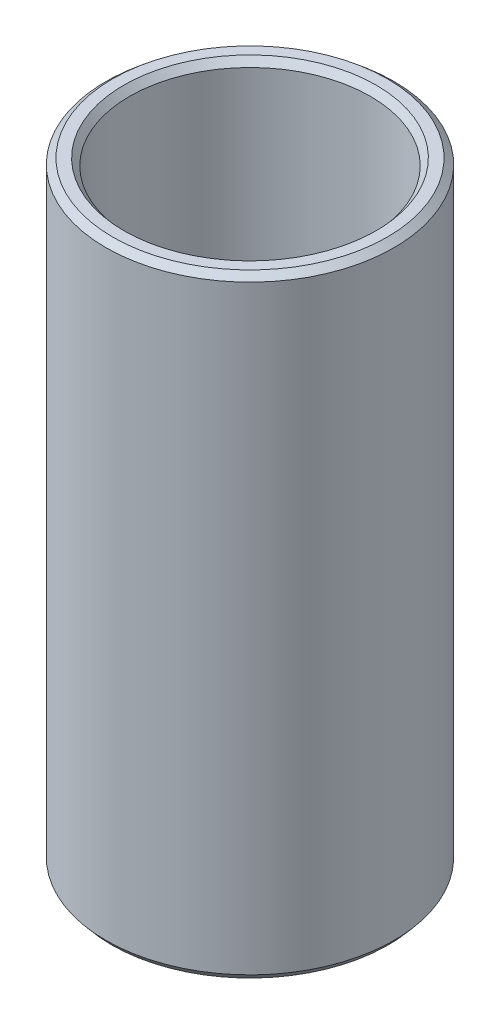
ISO-10303-21;
HEADER;
FILE_DESCRIPTION(('STEP AP214'),'2;1');
FILE_NAME('part.step','',(''),(''),'','','');
FILE_SCHEMA(('AUTOMOTIVE_DESIGN { 1 0 10303 214 1 1 1 1 }'));
ENDSEC;
DATA;
#1=APPLICATION_CONTEXT('core data for automotive mechanical design processes');
#2=APPLICATION_PROTOCOL_DEFINITION('international standard','automotive_design',2000,#1);
#3=PRODUCT_CONTEXT('',#1,'mechanical');
#4=PRODUCT('Part','Part','',(#3));
#5=PRODUCT_RELATED_PRODUCT_CATEGORY('part','',(#4));
#6=PRODUCT_DEFINITION_FORMATION('','',#4);
#7=PRODUCT_DEFINITION_CONTEXT('part definition',#1,'design');
#8=PRODUCT_DEFINITION('design','',#6,#7);
#9=PRODUCT_DEFINITION_SHAPE('','',#8);
#10=(LENGTH_UNIT() NAMED_UNIT(*) SI_UNIT(.MILLI.,.METRE.));
#11=(NAMED_UNIT(*) PLANE_ANGLE_UNIT() SI_UNIT($,.RADIAN.));
#12=(NAMED_UNIT(*) SI_UNIT($,.STERADIAN.) SOLID_ANGLE_UNIT());
#13=UNCERTAINTY_MEASURE_WITH_UNIT(LENGTH_MEASURE(1.E-05),#10,'distance_accuracy_value','');
#14=(GEOMETRIC_REPRESENTATION_CONTEXT(3) GLOBAL_UNCERTAINTY_ASSIGNED_CONTEXT((#13)) GLOBAL_UNIT_ASSIGNED_CONTEXT((#10,
#11,#12)) REPRESENTATION_CONTEXT('',''));
#15=CARTESIAN_POINT('',(0.,0.,0.));
#16=DIRECTION('',(0.,0.,1.));
#17=DIRECTION('',(1.,0.,0.));
#18=AXIS2_PLACEMENT_3D('',#15,#16,#17);
#19=CARTESIAN_POINT('',(0.,201.987912518107,0.));
#20=DIRECTION('',(0.,-1.,0.));
#21=DIRECTION('',(0.,0.,-1.));
#22=AXIS2_PLACEMENT_3D('',#19,#20,#21);
#23=CYLINDRICAL_SURFACE('',#22,47.5);
#24=CARTESIAN_POINT('',(0.,2.24651685545349,0.));
#25=DIRECTION('',(0.,1.,0.));
#26=DIRECTION('',(0.,0.,1.));
#27=AXIS2_PLACEMENT_3D('',#24,#25,#26);
#28=CIRCLE('',#27,47.5);
#29=CARTESIAN_POINT('',(0.,2.24651685545349,47.5));
#30=VERTEX_POINT('',#29);
#31=EDGE_CURVE('E10',#30,#30,#28,.T.);
#32=ORIENTED_EDGE('',*,*,#31,.T.);
#33=EDGE_LOOP('',(#32));
#34=FACE_BOUND('',#33,.T.);
#35=CARTESIAN_POINT('',(0.,200.089997163598,0.));
#36=DIRECTION('',(0.,1.,0.));
#37=DIRECTION('',(0.,0.,1.));
#38=AXIS2_PLACEMENT_3D('',#35,#36,#37);
#39=CIRCLE('',#38,47.5);
#40=CARTESIAN_POINT('',(0.,200.089997163598,-47.5));
#41=VERTEX_POINT('',#40);
#42=EDGE_CURVE('E50',#41,#41,#39,.F.);
#43=ORIENTED_EDGE('',*,*,#42,.T.);
#44=EDGE_LOOP('',(#43));
#45=FACE_BOUND('',#44,.T.);
#46=ADVANCED_FACE('F39',(#34,#45),#23,.T.);
#47=CARTESIAN_POINT('',(0.,201.987912518107,0.));
#48=DIRECTION('',(0.,1.,0.));
#49=DIRECTION('',(0.,0.,1.));
#50=AXIS2_PLACEMENT_3D('',#47,#48,#49);
#51=PLANE('',#50);
#52=CARTESIAN_POINT('',(0.,201.987912518107,0.));
#53=DIRECTION('',(0.,1.,0.));
#54=DIRECTION('',(0.,0.,1.));
#55=AXIS2_PLACEMENT_3D('',#52,#53,#54);
#56=CIRCLE('',#55,41.604513918867);
#57=CARTESIAN_POINT('',(0.,201.987912518107,41.604513918867));
#58=VERTEX_POINT('',#57);
#59=EDGE_CURVE('E58',#58,#58,#56,.F.);
#60=ORIENTED_EDGE('',*,*,#59,.T.);
#61=EDGE_LOOP('',(#60));
#62=FACE_BOUND('',#61,.T.);
#63=CARTESIAN_POINT('',(0.,201.987912518107,0.));
#64=DIRECTION('',(0.,1.,0.));
#65=DIRECTION('',(0.,0.,1.));
#66=AXIS2_PLACEMENT_3D('',#63,#64,#65);
#67=CIRCLE('',#66,45.2534831445465);
#68=CARTESIAN_POINT('',(0.,201.987912518107,-45.2534831445465));
#69=VERTEX_POINT('',#68);
#70=EDGE_CURVE('E61',#69,#69,#67,.T.);
#71=ORIENTED_EDGE('',*,*,#70,.T.);
#72=EDGE_LOOP('',(#71));
#73=FACE_BOUND('',#72,.T.);
#74=ADVANCED_FACE('F88',(#62,#73),#51,.T.);
#75=CARTESIAN_POINT('',(0.,0.,0.));
#76=DIRECTION('',(0.,1.,0.));
#77=DIRECTION('',(0.,0.,1.));
#78=AXIS2_PLACEMENT_3D('',#75,#76,#77);
#79=PLANE('',#78);
#80=CARTESIAN_POINT('',(0.,0.,0.));
#81=DIRECTION('',(0.,1.,0.));
#82=DIRECTION('',(0.,0.,1.));
#83=AXIS2_PLACEMENT_3D('',#80,#81,#82);
#84=CIRCLE('',#83,41.9531154198121);
#85=CARTESIAN_POINT('',(0.,0.,41.9531154198121));
#86=VERTEX_POINT('',#85);
#87=EDGE_CURVE('E51',#86,#86,#84,.T.);
#88=ORIENTED_EDGE('',*,*,#87,.T.);
#89=EDGE_LOOP('',(#88));
#90=FACE_BOUND('',#89,.T.);
#91=CARTESIAN_POINT('',(0.,0.,0.));
#92=DIRECTION('',(0.,1.,0.));
#93=DIRECTION('',(0.,0.,1.));
#94=AXIS2_PLACEMENT_3D('',#91,#92,#93);
#95=CIRCLE('',#94,45.6020846454915);
#96=CARTESIAN_POINT('',(0.,0.,45.6020846454915));
#97=VERTEX_POINT('',#96);
#98=EDGE_CURVE('E54',#97,#97,#95,.F.);
#99=ORIENTED_EDGE('',*,*,#98,.T.);
#100=EDGE_LOOP('',(#99));
#101=FACE_BOUND('',#100,.T.);
#102=ADVANCED_FACE('F83',(#90,#101),#79,.F.);
#103=CARTESIAN_POINT('',(0.,201.987912518107,0.));
#104=DIRECTION('',(0.,-1.,0.));
#105=DIRECTION('',(0.,0.,-1.));
#106=AXIS2_PLACEMENT_3D('',#103,#104,#105);
#107=CYLINDRICAL_SURFACE('',#106,39.7065985643585);
#108=CARTESIAN_POINT('',(0.,199.741395662653,0.));
#109=DIRECTION('',(0.,1.,0.));
#110=DIRECTION('',(0.,0.,1.));
#111=AXIS2_PLACEMENT_3D('',#108,#109,#110);
#112=CIRCLE('',#111,39.7065985643585);
#113=CARTESIAN_POINT('',(0.,199.741395662653,39.7065985643585));
#114=VERTEX_POINT('',#113);
#115=EDGE_CURVE('E67',#114,#114,#112,.T.);
#116=ORIENTED_EDGE('',*,*,#115,.T.);
#117=EDGE_LOOP('',(#116));
#118=FACE_BOUND('',#117,.T.);
#119=CARTESIAN_POINT('',(0.,1.89791535450856,0.));
#120=DIRECTION('',(0.,1.,0.));
#121=DIRECTION('',(0.,0.,1.));
#122=AXIS2_PLACEMENT_3D('',#119,#120,#121);
#123=CIRCLE('',#122,39.7065985643585);
#124=CARTESIAN_POINT('',(0.,1.89791535450856,39.7065985643585));
#125=VERTEX_POINT('',#124);
#126=EDGE_CURVE('E69',#125,#125,#123,.F.);
#127=ORIENTED_EDGE('',*,*,#126,.T.);
#128=EDGE_LOOP('',(#127));
#129=FACE_BOUND('',#128,.T.);
#130=ADVANCED_FACE('F71',(#118,#129),#107,.F.);
#131=CARTESIAN_POINT('',(0.,199.741395662653,0.));
#132=DIRECTION('',(0.,1.,0.));
#133=DIRECTION('',(0.,0.,1.));
#134=AXIS2_PLACEMENT_3D('',#131,#132,#133);
#135=CONICAL_SURFACE('',#134,39.7065985643585,0.701482482449643);
#136=ORIENTED_EDGE('',*,*,#59,.F.);
#137=EDGE_LOOP('',(#136));
#138=FACE_BOUND('',#137,.T.);
#139=ORIENTED_EDGE('',*,*,#115,.F.);
#140=EDGE_LOOP('',(#139));
#141=FACE_BOUND('',#140,.T.);
#142=ADVANCED_FACE('F77',(#138,#141),#135,.F.);
#143=CARTESIAN_POINT('',(0.,0.,0.));
#144=DIRECTION('',(0.,-1.,0.));
#145=DIRECTION('',(0.,0.,-1.));
#146=AXIS2_PLACEMENT_3D('',#143,#144,#145);
#147=CONICAL_SURFACE('',#146,41.9531154198121,0.869313844345249);
#148=ORIENTED_EDGE('',*,*,#126,.F.);
#149=EDGE_LOOP('',(#148));
#150=FACE_BOUND('',#149,.T.);
#151=ORIENTED_EDGE('',*,*,#87,.F.);
#152=EDGE_LOOP('',(#151));
#153=FACE_BOUND('',#152,.T.);
#154=ADVANCED_FACE('F73',(#150,#153),#147,.F.);
#155=CARTESIAN_POINT('',(0.,2.24651685545349,0.));
#156=DIRECTION('',(0.,1.,0.));
#157=DIRECTION('',(0.,0.,1.));
#158=AXIS2_PLACEMENT_3D('',#155,#156,#157);
#159=CONICAL_SURFACE('',#158,47.5,0.701482482449651);
#160=ORIENTED_EDGE('',*,*,#98,.F.);
#161=EDGE_LOOP('',(#160));
#162=FACE_BOUND('',#161,.T.);
#163=ORIENTED_EDGE('',*,*,#31,.F.);
#164=EDGE_LOOP('',(#163));
#165=FACE_BOUND('',#164,.T.);
#166=ADVANCED_FACE('F76',(#162,#165),#159,.T.);
#167=CARTESIAN_POINT('',(0.,201.987912518107,0.));
#168=DIRECTION('',(0.,-1.,0.));
#169=DIRECTION('',(0.,0.,-1.));
#170=AXIS2_PLACEMENT_3D('',#167,#168,#169);
#171=CONICAL_SURFACE('',#170,45.2534831445465,0.869313844345255);
#172=CARTESIAN_POINT('',(0.,200.089997163598,-47.5));
#173=CARTESIAN_POINT('',(0.,200.109767115208,-47.4765987827557));
#174=CARTESIAN_POINT('',(0.,200.129537066817,-47.4531975655114));
#175=CARTESIAN_POINT('',(0.,200.169076970036,-47.4063951310228));
#176=CARTESIAN_POINT('',(0.,200.188846921646,-47.3829939137785));
#177=CARTESIAN_POINT('',(0.,200.228386824864,-47.3361914792899));
#178=CARTESIAN_POINT('',(0.,200.248156776474,-47.3127902620456));
#179=CARTESIAN_POINT('',(0.,200.287696679693,-47.2659878275569));
#180=CARTESIAN_POINT('',(0.,200.307466631302,-47.2425866103126));
#181=CARTESIAN_POINT('',(0.,200.347006534521,-47.195784175824));
#182=CARTESIAN_POINT('',(0.,200.366776486131,-47.1723829585797));
#183=CARTESIAN_POINT('',(0.,200.40631638935,-47.1255805240911));
#184=CARTESIAN_POINT('',(0.,200.426086340959,-47.1021793068468));
#185=CARTESIAN_POINT('',(0.,200.465626244178,-47.0553768723582));
#186=CARTESIAN_POINT('',(0.,200.485396195787,-47.0319756551139));
#187=CARTESIAN_POINT('',(0.,200.524936099006,-46.9851732206253));
#188=CARTESIAN_POINT('',(0.,200.544706050616,-46.961772003381));
#189=CARTESIAN_POINT('',(0.,200.584245953835,-46.9149695688923));
#190=CARTESIAN_POINT('',(0.,200.604015905444,-46.891568351648));
#191=CARTESIAN_POINT('',(0.,200.643555808663,-46.8447659171594));
#192=CARTESIAN_POINT('',(0.,200.663325760273,-46.8213646999151));
#193=CARTESIAN_POINT('',(0.,200.702865663492,-46.7745622654265));
#194=CARTESIAN_POINT('',(0.,200.722635615101,-46.7511610481822));
#195=CARTESIAN_POINT('',(0.,200.76217551832,-46.7043586136936));
#196=CARTESIAN_POINT('',(0.,200.781945469929,-46.6809573964493));
#197=CARTESIAN_POINT('',(0.,200.821485373148,-46.6341549619606));
#198=CARTESIAN_POINT('',(0.,200.841255324758,-46.6107537447163));
#199=CARTESIAN_POINT('',(0.,200.880795227977,-46.5639513102277));
#200=CARTESIAN_POINT('',(0.,200.900565179586,-46.5405500929834));
#201=CARTESIAN_POINT('',(0.,200.940105082805,-46.4937476584948));
#202=CARTESIAN_POINT('',(0.,200.959875034415,-46.4703464412505));
#203=CARTESIAN_POINT('',(0.,200.999414937634,-46.4235440067619));
#204=CARTESIAN_POINT('',(0.,201.019184889243,-46.4001427895176));
#205=CARTESIAN_POINT('',(0.,201.058724792462,-46.353340355029));
#206=CARTESIAN_POINT('',(0.,201.078494744071,-46.3299391377847));
#207=CARTESIAN_POINT('',(0.,201.11803464729,-46.283136703296));
#208=CARTESIAN_POINT('',(0.,201.1378045989,-46.2597354860517));
#209=CARTESIAN_POINT('',(0.,201.177344502119,-46.2129330515631));
#210=CARTESIAN_POINT('',(0.,201.197114453728,-46.1895318343188));
#211=CARTESIAN_POINT('',(0.,201.236654356947,-46.1427293998302));
#212=CARTESIAN_POINT('',(0.,201.256424308557,-46.1193281825859));
#213=CARTESIAN_POINT('',(0.,201.295964211775,-46.0725257480973));
#214=CARTESIAN_POINT('',(0.,201.315734163385,-46.049124530853));
#215=CARTESIAN_POINT('',(0.,201.355274066604,-46.0023220963643));
#216=CARTESIAN_POINT('',(0.,201.375044018213,-45.97892087912));
#217=CARTESIAN_POINT('',(0.,201.414583921432,-45.9321184446314));
#218=CARTESIAN_POINT('',(0.,201.434353873042,-45.9087172273871));
#219=CARTESIAN_POINT('',(0.,201.473893776261,-45.8619147928985));
#220=CARTESIAN_POINT('',(0.,201.49366372787,-45.8385135756542));
#221=CARTESIAN_POINT('',(0.,201.533203631089,-45.7917111411656));
#222=CARTESIAN_POINT('',(0.,201.552973582698,-45.7683099239213));
#223=CARTESIAN_POINT('',(0.,201.592513485917,-45.7215074894327));
#224=CARTESIAN_POINT('',(0.,201.612283437527,-45.6981062721884));
#225=CARTESIAN_POINT('',(0.,201.651823340746,-45.6513038376997));
#226=CARTESIAN_POINT('',(0.,201.671593292355,-45.6279026204554));
#227=CARTESIAN_POINT('',(0.,201.711133195574,-45.5811001859668));
#228=CARTESIAN_POINT('',(0.,201.730903147184,-45.5576989687225));
#229=CARTESIAN_POINT('',(0.,201.770443050403,-45.5108965342339));
#230=CARTESIAN_POINT('',(0.,201.790213002012,-45.4874953169896));
#231=CARTESIAN_POINT('',(0.,201.829752905231,-45.440692882501));
#232=CARTESIAN_POINT('',(0.,201.84952285684,-45.4172916652567));
#233=CARTESIAN_POINT('',(0.,201.889062760059,-45.370489230768));
#234=CARTESIAN_POINT('',(0.,201.908832711669,-45.3470880135237));
#235=CARTESIAN_POINT('',(0.,201.948372614888,-45.3002855790351));
#236=CARTESIAN_POINT('',(0.,201.968142566497,-45.2768843617908));
#237=CARTESIAN_POINT('',(0.,201.987912518107,-45.2534831445465));
#238=B_SPLINE_CURVE_WITH_KNOTS('',3,(#172,#173,#174,#175,#176,#177,#178,#179,#180,#181,#182,
#183,#184,#185,#186,#187,#188,#189,#190,#191,#192,#193,#194,#195,#196,#197,#198,#199,#200,#201,
#202,#203,#204,#205,#206,#207,#208,#209,#210,#211,#212,#213,#214,#215,#216,#217,#218,#219,#220,
#221,#222,#223,#224,#225,#226,#227,#228,#229,#230,#231,#232,#233,#234,#235,#236,#237),
.UNSPECIFIED.,.F.,.F.,(4,2,2,2,2,2,2,2,2,2,2,2,2,2,2,2,2,2,2,2,2,2,2,2,2,2,2,2,2,2,2,2,4),(0.,
0.0919032730451126,0.183806546090202,0.275709819135297,0.367613092180409,0.459516365225504,
0.551419638270598,0.643322911315711,0.735226184360806,0.8271294574059,0.919032730451013,
1.01093600349611,1.1028392765412,1.19474254958631,1.28664582263141,1.3785490956765,
1.4704523687216,1.56235564176671,1.65425891481181,1.7461621878569,1.83806546090201,
1.92996873394711,2.0218720069922,2.11377528003732,2.20567855308241,2.2975818261275,
2.38948509917262,2.48138837221771,2.57329164526281,2.66519491830792,2.75709819135301,
2.84900146439811,2.94090473744322),.UNSPECIFIED.);
#239=EDGE_CURVE('BSEAM45',#41,#69,#238,.T.);
#240=ORIENTED_EDGE('',*,*,#42,.F.);
#241=ORIENTED_EDGE('',*,*,#70,.F.);
#242=ORIENTED_EDGE('',*,*,#239,.T.);
#243=ORIENTED_EDGE('',*,*,#239,.F.);
#244=EDGE_LOOP('',(#240,#242,#241,#243));
#245=FACE_BOUND('',#244,.T.);
#246=ADVANCED_FACE('F45',(#245),#171,.T.);
#247=CLOSED_SHELL('',(#46,#74,#102,#130,#142,#154,#166,#246));
#248=MANIFOLD_SOLID_BREP('B2',#247);
#249=ADVANCED_BREP_SHAPE_REPRESENTATION('',(#18,#248),#14);
#250=SHAPE_DEFINITION_REPRESENTATION(#9,#249);
ENDSEC;
END-ISO-10303-21;
